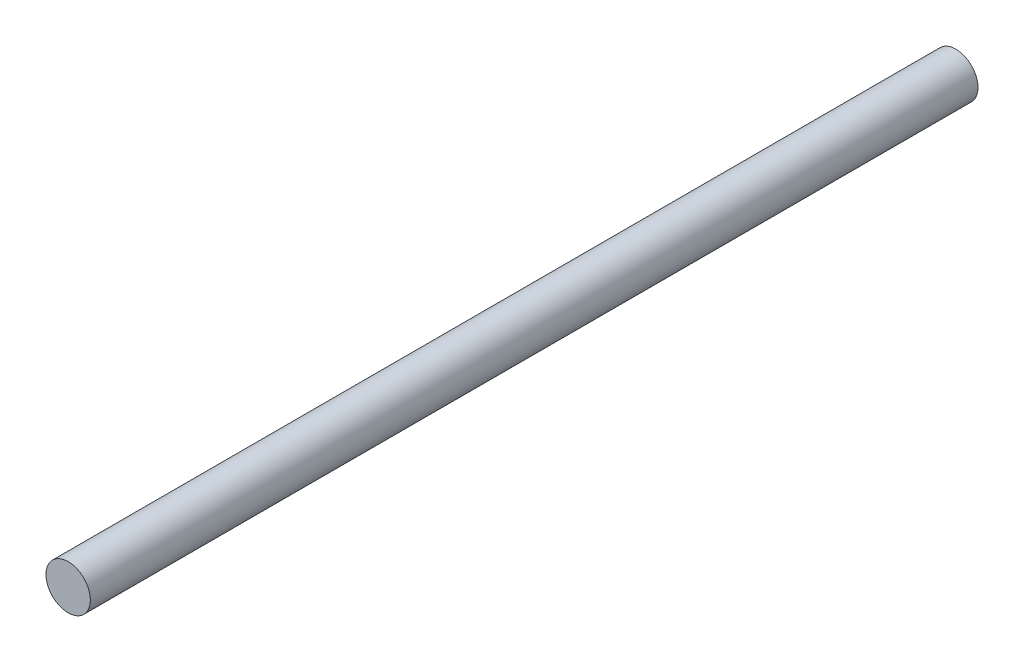
ISO-10303-21;
HEADER;
FILE_DESCRIPTION(('STEP AP214'),'2;1');
FILE_NAME('part.step','',(''),(''),'','','');
FILE_SCHEMA(('AUTOMOTIVE_DESIGN { 1 0 10303 214 1 1 1 1 }'));
ENDSEC;
DATA;
#1=APPLICATION_CONTEXT('core data for automotive mechanical design processes');
#2=APPLICATION_PROTOCOL_DEFINITION('international standard','automotive_design',2000,#1);
#3=PRODUCT_CONTEXT('',#1,'mechanical');
#4=PRODUCT('Part','Part','',(#3));
#5=PRODUCT_RELATED_PRODUCT_CATEGORY('part','',(#4));
#6=PRODUCT_DEFINITION_FORMATION('','',#4);
#7=PRODUCT_DEFINITION_CONTEXT('part definition',#1,'design');
#8=PRODUCT_DEFINITION('design','',#6,#7);
#9=PRODUCT_DEFINITION_SHAPE('','',#8);
#10=(LENGTH_UNIT() NAMED_UNIT(*) SI_UNIT(.MILLI.,.METRE.));
#11=(NAMED_UNIT(*) PLANE_ANGLE_UNIT() SI_UNIT($,.RADIAN.));
#12=(NAMED_UNIT(*) SI_UNIT($,.STERADIAN.) SOLID_ANGLE_UNIT());
#13=UNCERTAINTY_MEASURE_WITH_UNIT(LENGTH_MEASURE(1.E-05),#10,'distance_accuracy_value','');
#14=(GEOMETRIC_REPRESENTATION_CONTEXT(3) GLOBAL_UNCERTAINTY_ASSIGNED_CONTEXT((#13)) GLOBAL_UNIT_ASSIGNED_CONTEXT((#10,
#11,#12)) REPRESENTATION_CONTEXT('',''));
#15=CARTESIAN_POINT('',(0.,0.,0.));
#16=DIRECTION('',(0.,0.,1.));
#17=DIRECTION('',(1.,0.,0.));
#18=AXIS2_PLACEMENT_3D('',#15,#16,#17);
#19=CARTESIAN_POINT('',(0.,0.,160.));
#20=DIRECTION('',(0.,0.,-1.));
#21=DIRECTION('',(-1.,0.,0.));
#22=AXIS2_PLACEMENT_3D('',#19,#20,#21);
#23=CYLINDRICAL_SURFACE('',#22,4.);
#24=CARTESIAN_POINT('',(0.,0.,160.));
#25=DIRECTION('',(0.,0.,1.));
#26=DIRECTION('',(1.,0.,0.));
#27=AXIS2_PLACEMENT_3D('',#24,#25,#26);
#28=CIRCLE('',#27,4.);
#29=CARTESIAN_POINT('',(4.,0.,160.));
#30=VERTEX_POINT('',#29);
#31=EDGE_CURVE('E10',#30,#30,#28,.T.);
#32=ORIENTED_EDGE('',*,*,#31,.F.);
#33=EDGE_LOOP('',(#32));
#34=FACE_BOUND('',#33,.T.);
#35=CARTESIAN_POINT('',(0.,0.,0.));
#36=DIRECTION('',(0.,0.,1.));
#37=DIRECTION('',(1.,0.,0.));
#38=AXIS2_PLACEMENT_3D('',#35,#36,#37);
#39=CIRCLE('',#38,4.);
#40=CARTESIAN_POINT('',(4.,0.,0.));
#41=VERTEX_POINT('',#40);
#42=EDGE_CURVE('E34',#41,#41,#39,.T.);
#43=ORIENTED_EDGE('',*,*,#42,.T.);
#44=EDGE_LOOP('',(#43));
#45=FACE_BOUND('',#44,.T.);
#46=ADVANCED_FACE('F31',(#34,#45),#23,.T.);
#47=CARTESIAN_POINT('',(0.,0.,160.));
#48=DIRECTION('',(0.,0.,1.));
#49=DIRECTION('',(1.,0.,0.));
#50=AXIS2_PLACEMENT_3D('',#47,#48,#49);
#51=PLANE('',#50);
#52=ORIENTED_EDGE('',*,*,#31,.T.);
#53=EDGE_LOOP('',(#52));
#54=FACE_BOUND('',#53,.T.);
#55=ADVANCED_FACE('F46',(#54),#51,.T.);
#56=CARTESIAN_POINT('',(0.,0.,0.));
#57=DIRECTION('',(0.,0.,1.));
#58=DIRECTION('',(1.,0.,0.));
#59=AXIS2_PLACEMENT_3D('',#56,#57,#58);
#60=PLANE('',#59);
#61=ORIENTED_EDGE('',*,*,#42,.F.);
#62=EDGE_LOOP('',(#61));
#63=FACE_BOUND('',#62,.T.);
#64=ADVANCED_FACE('F44',(#63),#60,.F.);
#65=CLOSED_SHELL('',(#46,#55,#64));
#66=MANIFOLD_SOLID_BREP('B2',#65);
#67=ADVANCED_BREP_SHAPE_REPRESENTATION('',(#18,#66),#14);
#68=SHAPE_DEFINITION_REPRESENTATION(#9,#67);
ENDSEC;
END-ISO-10303-21;
